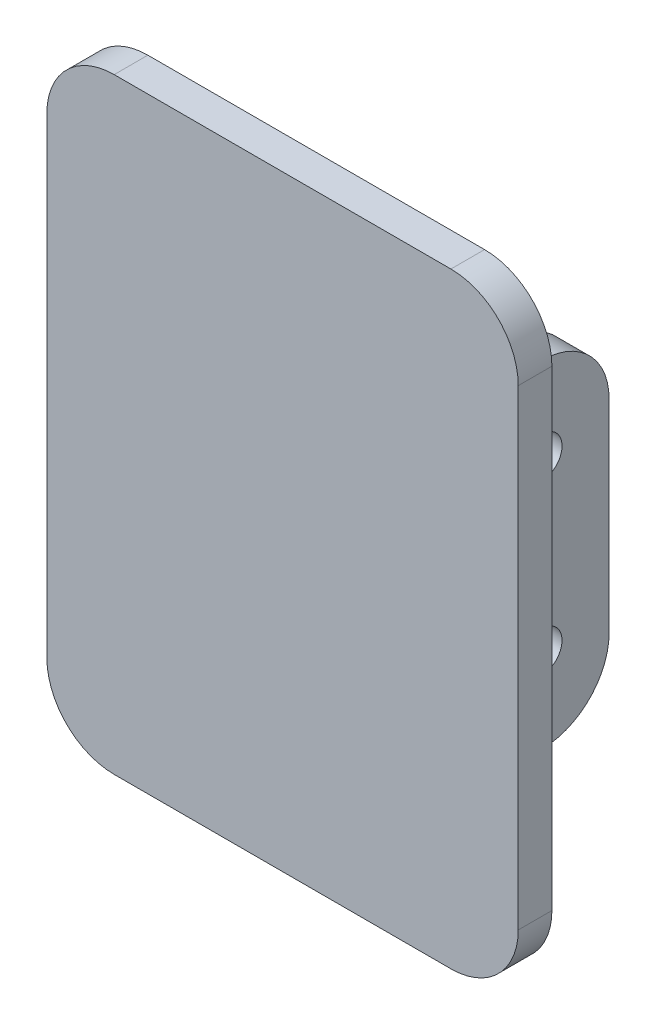
ISO-10303-21;
HEADER;
FILE_DESCRIPTION(('STEP AP214'),'2;1');
FILE_NAME('part.step','',(''),(''),'','','');
FILE_SCHEMA(('AUTOMOTIVE_DESIGN { 1 0 10303 214 1 1 1 1 }'));
ENDSEC;
DATA;
#1=APPLICATION_CONTEXT('core data for automotive mechanical design processes');
#2=APPLICATION_PROTOCOL_DEFINITION('international standard','automotive_design',2000,#1);
#3=PRODUCT_CONTEXT('',#1,'mechanical');
#4=PRODUCT('Part','Part','',(#3));
#5=PRODUCT_RELATED_PRODUCT_CATEGORY('part','',(#4));
#6=PRODUCT_DEFINITION_FORMATION('','',#4);
#7=PRODUCT_DEFINITION_CONTEXT('part definition',#1,'design');
#8=PRODUCT_DEFINITION('design','',#6,#7);
#9=PRODUCT_DEFINITION_SHAPE('','',#8);
#10=(LENGTH_UNIT() NAMED_UNIT(*) SI_UNIT(.MILLI.,.METRE.));
#11=(NAMED_UNIT(*) PLANE_ANGLE_UNIT() SI_UNIT($,.RADIAN.));
#12=(NAMED_UNIT(*) SI_UNIT($,.STERADIAN.) SOLID_ANGLE_UNIT());
#13=UNCERTAINTY_MEASURE_WITH_UNIT(LENGTH_MEASURE(1.E-05),#10,'distance_accuracy_value','');
#14=(GEOMETRIC_REPRESENTATION_CONTEXT(3) GLOBAL_UNCERTAINTY_ASSIGNED_CONTEXT((#13)) GLOBAL_UNIT_ASSIGNED_CONTEXT((#10,
#11,#12)) REPRESENTATION_CONTEXT('',''));
#15=CARTESIAN_POINT('',(0.,0.,0.));
#16=DIRECTION('',(0.,0.,1.));
#17=DIRECTION('',(1.,0.,0.));
#18=AXIS2_PLACEMENT_3D('',#15,#16,#17);
#19=CARTESIAN_POINT('',(0.,0.,0.));
#20=DIRECTION('',(0.,0.,1.));
#21=DIRECTION('',(1.,0.,0.));
#22=AXIS2_PLACEMENT_3D('',#19,#20,#21);
#23=PLANE('',#22);
#24=DIRECTION('',(1.,0.,0.));
#25=VECTOR('',#24,1.);
#26=CARTESIAN_POINT('',(18.5,28.,0.));
#27=LINE('',#26,#25);
#28=CARTESIAN_POINT('',(26.5,28.,0.));
#29=VERTEX_POINT('',#28);
#30=CARTESIAN_POINT('',(18.5,28.,0.));
#31=VERTEX_POINT('',#30);
#32=EDGE_CURVE('E234',#29,#31,#27,.F.);
#33=ORIENTED_EDGE('',*,*,#32,.T.);
#34=DIRECTION('',(0.,1.,0.));
#35=VECTOR('',#34,1.);
#36=CARTESIAN_POINT('',(18.5,25.,0.));
#37=LINE('',#36,#35);
#38=CARTESIAN_POINT('',(18.5,-28.,0.));
#39=VERTEX_POINT('',#38);
#40=EDGE_CURVE('E411',#39,#31,#37,.T.);
#41=ORIENTED_EDGE('',*,*,#40,.F.);
#42=DIRECTION('',(-1.,0.,0.));
#43=VECTOR('',#42,1.);
#44=CARTESIAN_POINT('',(23.5,-28.,0.));
#45=LINE('',#44,#43);
#46=CARTESIAN_POINT('',(26.5,-28.,0.));
#47=VERTEX_POINT('',#46);
#48=EDGE_CURVE('E245',#39,#47,#45,.F.);
#49=ORIENTED_EDGE('',*,*,#48,.T.);
#50=DIRECTION('',(0.,-1.,0.));
#51=VECTOR('',#50,1.);
#52=CARTESIAN_POINT('',(26.5,25.,0.));
#53=LINE('',#52,#51);
#54=EDGE_CURVE('E231',#47,#29,#53,.F.);
#55=ORIENTED_EDGE('',*,*,#54,.T.);
#56=EDGE_LOOP('',(#33,#41,#49,#55));
#57=FACE_BOUND('',#56,.T.);
#58=DIRECTION('',(1.,0.,0.));
#59=VECTOR('',#58,1.);
#60=CARTESIAN_POINT('',(-35.,-45.,0.));
#61=LINE('',#60,#59);
#62=CARTESIAN_POINT('',(-25.,-45.,0.));
#63=VERTEX_POINT('',#62);
#64=CARTESIAN_POINT('',(25.,-45.,0.));
#65=VERTEX_POINT('',#64);
#66=EDGE_CURVE('E377',#63,#65,#61,.T.);
#67=ORIENTED_EDGE('',*,*,#66,.F.);
#68=CARTESIAN_POINT('',(-25.,-35.,0.));
#69=DIRECTION('',(0.,0.,1.));
#70=DIRECTION('',(1.,0.,0.));
#71=AXIS2_PLACEMENT_3D('',#68,#69,#70);
#72=CIRCLE('',#71,10.);
#73=CARTESIAN_POINT('',(-35.,-35.,0.));
#74=VERTEX_POINT('',#73);
#75=EDGE_CURVE('E332',#63,#74,#72,.F.);
#76=ORIENTED_EDGE('',*,*,#75,.T.);
#77=DIRECTION('',(0.,-1.,0.));
#78=VECTOR('',#77,1.);
#79=CARTESIAN_POINT('',(-35.,45.,0.));
#80=LINE('',#79,#78);
#81=CARTESIAN_POINT('',(-35.,35.,0.));
#82=VERTEX_POINT('',#81);
#83=EDGE_CURVE('E369',#82,#74,#80,.T.);
#84=ORIENTED_EDGE('',*,*,#83,.F.);
#85=CARTESIAN_POINT('',(-25.,35.,0.));
#86=DIRECTION('',(0.,0.,1.));
#87=DIRECTION('',(1.,0.,0.));
#88=AXIS2_PLACEMENT_3D('',#85,#86,#87);
#89=CIRCLE('',#88,10.);
#90=CARTESIAN_POINT('',(-25.,45.,0.));
#91=VERTEX_POINT('',#90);
#92=EDGE_CURVE('E326',#82,#91,#89,.F.);
#93=ORIENTED_EDGE('',*,*,#92,.T.);
#94=DIRECTION('',(-1.,0.,0.));
#95=VECTOR('',#94,1.);
#96=CARTESIAN_POINT('',(-35.,45.,0.));
#97=LINE('',#96,#95);
#98=CARTESIAN_POINT('',(25.,45.,0.));
#99=VERTEX_POINT('',#98);
#100=EDGE_CURVE('E366',#99,#91,#97,.T.);
#101=ORIENTED_EDGE('',*,*,#100,.F.);
#102=CARTESIAN_POINT('',(25.,35.,0.));
#103=DIRECTION('',(0.,0.,1.));
#104=DIRECTION('',(1.,0.,0.));
#105=AXIS2_PLACEMENT_3D('',#102,#103,#104);
#106=CIRCLE('',#105,10.);
#107=CARTESIAN_POINT('',(35.,35.,0.));
#108=VERTEX_POINT('',#107);
#109=EDGE_CURVE('E328',#99,#108,#106,.F.);
#110=ORIENTED_EDGE('',*,*,#109,.T.);
#111=DIRECTION('',(0.,1.,0.));
#112=VECTOR('',#111,1.);
#113=CARTESIAN_POINT('',(35.,45.,0.));
#114=LINE('',#113,#112);
#115=CARTESIAN_POINT('',(35.,-35.,0.));
#116=VERTEX_POINT('',#115);
#117=EDGE_CURVE('E356',#116,#108,#114,.T.);
#118=ORIENTED_EDGE('',*,*,#117,.F.);
#119=CARTESIAN_POINT('',(25.,-35.,0.));
#120=DIRECTION('',(0.,0.,1.));
#121=DIRECTION('',(1.,0.,0.));
#122=AXIS2_PLACEMENT_3D('',#119,#120,#121);
#123=CIRCLE('',#122,10.);
#124=EDGE_CURVE('E330',#116,#65,#123,.F.);
#125=ORIENTED_EDGE('',*,*,#124,.T.);
#126=EDGE_LOOP('',(#67,#76,#84,#93,#101,#110,#118,#125));
#127=FACE_BOUND('',#126,.T.);
#128=DIRECTION('',(0.,-1.,0.));
#129=VECTOR('',#128,1.);
#130=CARTESIAN_POINT('',(3.50000000000001,25.,0.));
#131=LINE('',#130,#129);
#132=CARTESIAN_POINT('',(3.50000000000001,28.,0.));
#133=VERTEX_POINT('',#132);
#134=CARTESIAN_POINT('',(3.5,-28.,0.));
#135=VERTEX_POINT('',#134);
#136=EDGE_CURVE('E399',#133,#135,#131,.T.);
#137=ORIENTED_EDGE('',*,*,#136,.F.);
#138=DIRECTION('',(1.,0.,0.));
#139=VECTOR('',#138,1.);
#140=CARTESIAN_POINT('',(-1.49999999999999,28.,0.));
#141=LINE('',#140,#139);
#142=CARTESIAN_POINT('',(-4.49999999999999,28.,0.));
#143=VERTEX_POINT('',#142);
#144=EDGE_CURVE('E224',#133,#143,#141,.F.);
#145=ORIENTED_EDGE('',*,*,#144,.T.);
#146=DIRECTION('',(0.,1.,0.));
#147=VECTOR('',#146,1.);
#148=CARTESIAN_POINT('',(-4.5,-25.,0.));
#149=LINE('',#148,#147);
#150=CARTESIAN_POINT('',(-4.5,-28.,0.));
#151=VERTEX_POINT('',#150);
#152=EDGE_CURVE('E250',#143,#151,#149,.F.);
#153=ORIENTED_EDGE('',*,*,#152,.T.);
#154=DIRECTION('',(-1.,0.,0.));
#155=VECTOR('',#154,1.);
#156=CARTESIAN_POINT('',(3.5,-28.,0.));
#157=LINE('',#156,#155);
#158=EDGE_CURVE('E247',#151,#135,#157,.F.);
#159=ORIENTED_EDGE('',*,*,#158,.T.);
#160=EDGE_LOOP('',(#137,#145,#153,#159));
#161=FACE_BOUND('',#160,.T.);
#162=ADVANCED_FACE('F44',(#57,#127,#161),#23,.F.);
#163=CARTESIAN_POINT('',(35.,45.,5.));
#164=DIRECTION('',(-1.,0.,0.));
#165=DIRECTION('',(0.,-1.,0.));
#166=AXIS2_PLACEMENT_3D('',#163,#164,#165);
#167=PLANE('',#166);
#168=DIRECTION('',(0.,1.,0.));
#169=VECTOR('',#168,1.);
#170=CARTESIAN_POINT('',(35.,45.,5.));
#171=LINE('',#170,#169);
#172=CARTESIAN_POINT('',(35.,-35.,5.));
#173=VERTEX_POINT('',#172);
#174=CARTESIAN_POINT('',(35.,35.,5.));
#175=VERTEX_POINT('',#174);
#176=EDGE_CURVE('E358',#173,#175,#171,.T.);
#177=ORIENTED_EDGE('',*,*,#176,.F.);
#178=DIRECTION('',(0.,0.,-1.));
#179=VECTOR('',#178,1.);
#180=CARTESIAN_POINT('',(35.,-35.,5.));
#181=LINE('',#180,#179);
#182=EDGE_CURVE('E348',#173,#116,#181,.T.);
#183=ORIENTED_EDGE('',*,*,#182,.T.);
#184=ORIENTED_EDGE('',*,*,#117,.T.);
#185=DIRECTION('',(0.,0.,-1.));
#186=VECTOR('',#185,1.);
#187=CARTESIAN_POINT('',(35.,35.,5.));
#188=LINE('',#187,#186);
#189=EDGE_CURVE('E346',#108,#175,#188,.F.);
#190=ORIENTED_EDGE('',*,*,#189,.T.);
#191=EDGE_LOOP('',(#177,#183,#184,#190));
#192=FACE_BOUND('',#191,.T.);
#193=ADVANCED_FACE('F355',(#192),#167,.F.);
#194=CARTESIAN_POINT('',(-35.,45.,5.));
#195=DIRECTION('',(0.,-1.,0.));
#196=DIRECTION('',(0.,0.,-1.));
#197=AXIS2_PLACEMENT_3D('',#194,#195,#196);
#198=PLANE('',#197);
#199=DIRECTION('',(-1.,0.,0.));
#200=VECTOR('',#199,1.);
#201=CARTESIAN_POINT('',(-35.,45.,5.));
#202=LINE('',#201,#200);
#203=CARTESIAN_POINT('',(25.,45.,5.));
#204=VERTEX_POINT('',#203);
#205=CARTESIAN_POINT('',(-25.,45.,5.));
#206=VERTEX_POINT('',#205);
#207=EDGE_CURVE('E425',#204,#206,#202,.T.);
#208=ORIENTED_EDGE('',*,*,#207,.F.);
#209=DIRECTION('',(0.,0.,-1.));
#210=VECTOR('',#209,1.);
#211=CARTESIAN_POINT('',(25.,45.,5.));
#212=LINE('',#211,#210);
#213=EDGE_CURVE('E13',#204,#99,#212,.T.);
#214=ORIENTED_EDGE('',*,*,#213,.T.);
#215=ORIENTED_EDGE('',*,*,#100,.T.);
#216=DIRECTION('',(0.,0.,-1.));
#217=VECTOR('',#216,1.);
#218=CARTESIAN_POINT('',(-25.,45.,5.));
#219=LINE('',#218,#217);
#220=EDGE_CURVE('E52',#91,#206,#219,.F.);
#221=ORIENTED_EDGE('',*,*,#220,.T.);
#222=EDGE_LOOP('',(#208,#214,#215,#221));
#223=FACE_BOUND('',#222,.T.);
#224=ADVANCED_FACE('F444',(#223),#198,.F.);
#225=CARTESIAN_POINT('',(-35.,45.,5.));
#226=DIRECTION('',(1.,0.,0.));
#227=DIRECTION('',(0.,1.,0.));
#228=AXIS2_PLACEMENT_3D('',#225,#226,#227);
#229=PLANE('',#228);
#230=ORIENTED_EDGE('',*,*,#83,.T.);
#231=DIRECTION('',(0.,0.,-1.));
#232=VECTOR('',#231,1.);
#233=CARTESIAN_POINT('',(-35.,-35.,5.));
#234=LINE('',#233,#232);
#235=CARTESIAN_POINT('',(-35.,-35.,5.));
#236=VERTEX_POINT('',#235);
#237=EDGE_CURVE('E337',#74,#236,#234,.F.);
#238=ORIENTED_EDGE('',*,*,#237,.T.);
#239=DIRECTION('',(0.,-1.,0.));
#240=VECTOR('',#239,1.);
#241=CARTESIAN_POINT('',(-35.,45.,5.));
#242=LINE('',#241,#240);
#243=CARTESIAN_POINT('',(-35.,35.,5.));
#244=VERTEX_POINT('',#243);
#245=EDGE_CURVE('E237',#244,#236,#242,.T.);
#246=ORIENTED_EDGE('',*,*,#245,.F.);
#247=DIRECTION('',(0.,0.,-1.));
#248=VECTOR('',#247,1.);
#249=CARTESIAN_POINT('',(-35.,35.,5.));
#250=LINE('',#249,#248);
#251=EDGE_CURVE('E334',#244,#82,#250,.T.);
#252=ORIENTED_EDGE('',*,*,#251,.T.);
#253=EDGE_LOOP('',(#230,#238,#246,#252));
#254=FACE_BOUND('',#253,.T.);
#255=ADVANCED_FACE('F442',(#254),#229,.F.);
#256=CARTESIAN_POINT('',(-35.,-45.,5.));
#257=DIRECTION('',(0.,1.,0.));
#258=DIRECTION('',(0.,0.,1.));
#259=AXIS2_PLACEMENT_3D('',#256,#257,#258);
#260=PLANE('',#259);
#261=DIRECTION('',(1.,0.,0.));
#262=VECTOR('',#261,1.);
#263=CARTESIAN_POINT('',(-35.,-45.,5.));
#264=LINE('',#263,#262);
#265=CARTESIAN_POINT('',(-25.,-45.,5.));
#266=VERTEX_POINT('',#265);
#267=CARTESIAN_POINT('',(25.,-45.,5.));
#268=VERTEX_POINT('',#267);
#269=EDGE_CURVE('E232',#266,#268,#264,.T.);
#270=ORIENTED_EDGE('',*,*,#269,.F.);
#271=DIRECTION('',(0.,0.,-1.));
#272=VECTOR('',#271,1.);
#273=CARTESIAN_POINT('',(-25.,-45.,5.));
#274=LINE('',#273,#272);
#275=EDGE_CURVE('E323',#266,#63,#274,.T.);
#276=ORIENTED_EDGE('',*,*,#275,.T.);
#277=ORIENTED_EDGE('',*,*,#66,.T.);
#278=DIRECTION('',(0.,0.,-1.));
#279=VECTOR('',#278,1.);
#280=CARTESIAN_POINT('',(25.,-45.,5.));
#281=LINE('',#280,#279);
#282=EDGE_CURVE('E321',#65,#268,#281,.F.);
#283=ORIENTED_EDGE('',*,*,#282,.T.);
#284=EDGE_LOOP('',(#270,#276,#277,#283));
#285=FACE_BOUND('',#284,.T.);
#286=ADVANCED_FACE('F439',(#285),#260,.F.);
#287=CARTESIAN_POINT('',(0.,0.,5.));
#288=DIRECTION('',(0.,0.,1.));
#289=DIRECTION('',(1.,0.,0.));
#290=AXIS2_PLACEMENT_3D('',#287,#288,#289);
#291=PLANE('',#290);
#292=ORIENTED_EDGE('',*,*,#245,.T.);
#293=CARTESIAN_POINT('',(-25.,-35.,5.));
#294=DIRECTION('',(0.,0.,1.));
#295=DIRECTION('',(1.,0.,0.));
#296=AXIS2_PLACEMENT_3D('',#293,#294,#295);
#297=CIRCLE('',#296,10.);
#298=EDGE_CURVE('E344',#236,#266,#297,.T.);
#299=ORIENTED_EDGE('',*,*,#298,.T.);
#300=ORIENTED_EDGE('',*,*,#269,.T.);
#301=CARTESIAN_POINT('',(25.,-35.,5.));
#302=DIRECTION('',(0.,0.,1.));
#303=DIRECTION('',(1.,0.,0.));
#304=AXIS2_PLACEMENT_3D('',#301,#302,#303);
#305=CIRCLE('',#304,10.);
#306=EDGE_CURVE('E342',#268,#173,#305,.T.);
#307=ORIENTED_EDGE('',*,*,#306,.T.);
#308=ORIENTED_EDGE('',*,*,#176,.T.);
#309=CARTESIAN_POINT('',(25.,35.,5.));
#310=DIRECTION('',(0.,0.,1.));
#311=DIRECTION('',(1.,0.,0.));
#312=AXIS2_PLACEMENT_3D('',#309,#310,#311);
#313=CIRCLE('',#312,10.);
#314=EDGE_CURVE('E65',#175,#204,#313,.T.);
#315=ORIENTED_EDGE('',*,*,#314,.T.);
#316=ORIENTED_EDGE('',*,*,#207,.T.);
#317=CARTESIAN_POINT('',(-25.,35.,5.));
#318=DIRECTION('',(0.,0.,1.));
#319=DIRECTION('',(1.,0.,0.));
#320=AXIS2_PLACEMENT_3D('',#317,#318,#319);
#321=CIRCLE('',#320,10.);
#322=EDGE_CURVE('E339',#206,#244,#321,.T.);
#323=ORIENTED_EDGE('',*,*,#322,.T.);
#324=EDGE_LOOP('',(#292,#299,#300,#307,#308,#315,#316,#323));
#325=FACE_BOUND('',#324,.T.);
#326=ADVANCED_FACE('F429',(#325),#291,.T.);
#327=CARTESIAN_POINT('',(18.5,25.,-20.));
#328=DIRECTION('',(1.,0.,0.));
#329=DIRECTION('',(0.,1.,0.));
#330=AXIS2_PLACEMENT_3D('',#327,#328,#329);
#331=PLANE('',#330);
#332=CARTESIAN_POINT('',(18.5,-12.5,-10.));
#333=DIRECTION('',(1.,0.,0.));
#334=DIRECTION('',(0.,1.,0.));
#335=AXIS2_PLACEMENT_3D('',#332,#333,#334);
#336=CIRCLE('',#335,3.);
#337=CARTESIAN_POINT('',(18.5,-9.50000000000001,-10.));
#338=VERTEX_POINT('',#337);
#339=EDGE_CURVE('E388',#338,#338,#336,.T.);
#340=ORIENTED_EDGE('',*,*,#339,.T.);
#341=EDGE_LOOP('',(#340));
#342=FACE_BOUND('',#341,.T.);
#343=CARTESIAN_POINT('',(18.5,12.5,-10.));
#344=DIRECTION('',(1.,0.,0.));
#345=DIRECTION('',(0.,1.,0.));
#346=AXIS2_PLACEMENT_3D('',#343,#344,#345);
#347=CIRCLE('',#346,3.);
#348=CARTESIAN_POINT('',(18.5,15.5,-10.));
#349=VERTEX_POINT('',#348);
#350=EDGE_CURVE('E385',#349,#349,#347,.T.);
#351=ORIENTED_EDGE('',*,*,#350,.T.);
#352=EDGE_LOOP('',(#351));
#353=FACE_BOUND('',#352,.T.);
#354=DIRECTION('',(0.,1.,0.));
#355=VECTOR('',#354,1.);
#356=CARTESIAN_POINT('',(18.5,25.,-20.));
#357=LINE('',#356,#355);
#358=CARTESIAN_POINT('',(18.5,-15.,-20.));
#359=VERTEX_POINT('',#358);
#360=CARTESIAN_POINT('',(18.5,15.,-20.));
#361=VERTEX_POINT('',#360);
#362=EDGE_CURVE('E412',#359,#361,#357,.T.);
#363=ORIENTED_EDGE('',*,*,#362,.F.);
#364=CARTESIAN_POINT('',(18.5,-15.,-10.));
#365=DIRECTION('',(1.,0.,0.));
#366=DIRECTION('',(0.,1.,0.));
#367=AXIS2_PLACEMENT_3D('',#364,#365,#366);
#368=CIRCLE('',#367,10.);
#369=CARTESIAN_POINT('',(18.5,-25.,-10.));
#370=VERTEX_POINT('',#369);
#371=EDGE_CURVE('E311',#359,#370,#368,.F.);
#372=ORIENTED_EDGE('',*,*,#371,.T.);
#373=DIRECTION('',(0.,0.,1.));
#374=VECTOR('',#373,1.);
#375=CARTESIAN_POINT('',(18.5,-25.,-20.));
#376=LINE('',#375,#374);
#377=CARTESIAN_POINT('',(18.5,-25.,-3.));
#378=VERTEX_POINT('',#377);
#379=EDGE_CURVE('E418',#370,#378,#376,.T.);
#380=ORIENTED_EDGE('',*,*,#379,.T.);
#381=CARTESIAN_POINT('',(18.5,-28.,-3.));
#382=DIRECTION('',(1.,0.,0.));
#383=DIRECTION('',(0.,1.,0.));
#384=AXIS2_PLACEMENT_3D('',#381,#382,#383);
#385=CIRCLE('',#384,3.);
#386=EDGE_CURVE('E268',#378,#39,#385,.T.);
#387=ORIENTED_EDGE('',*,*,#386,.T.);
#388=ORIENTED_EDGE('',*,*,#40,.T.);
#389=CARTESIAN_POINT('',(18.5,28.,-3.));
#390=DIRECTION('',(1.,0.,0.));
#391=DIRECTION('',(0.,1.,0.));
#392=AXIS2_PLACEMENT_3D('',#389,#390,#391);
#393=CIRCLE('',#392,3.);
#394=CARTESIAN_POINT('',(18.5,25.,-3.));
#395=VERTEX_POINT('',#394);
#396=EDGE_CURVE('E271',#31,#395,#393,.T.);
#397=ORIENTED_EDGE('',*,*,#396,.T.);
#398=DIRECTION('',(0.,0.,1.));
#399=VECTOR('',#398,1.);
#400=CARTESIAN_POINT('',(18.5,25.,-20.));
#401=LINE('',#400,#399);
#402=CARTESIAN_POINT('',(18.5,25.,-10.));
#403=VERTEX_POINT('',#402);
#404=EDGE_CURVE('E367',#403,#395,#401,.T.);
#405=ORIENTED_EDGE('',*,*,#404,.F.);
#406=CARTESIAN_POINT('',(18.5,15.,-10.));
#407=DIRECTION('',(1.,0.,0.));
#408=DIRECTION('',(0.,1.,0.));
#409=AXIS2_PLACEMENT_3D('',#406,#407,#408);
#410=CIRCLE('',#409,10.);
#411=EDGE_CURVE('E309',#403,#361,#410,.F.);
#412=ORIENTED_EDGE('',*,*,#411,.T.);
#413=EDGE_LOOP('',(#363,#372,#380,#387,#388,#397,#405,#412));
#414=FACE_BOUND('',#413,.T.);
#415=ADVANCED_FACE('F518',(#342,#353,#414),#331,.F.);
#416=CARTESIAN_POINT('',(23.5,25.,-20.));
#417=DIRECTION('',(0.,-1.,0.));
#418=DIRECTION('',(0.,0.,-1.));
#419=AXIS2_PLACEMENT_3D('',#416,#417,#418);
#420=PLANE('',#419);
#421=DIRECTION('',(0.,0.,1.));
#422=VECTOR('',#421,1.);
#423=CARTESIAN_POINT('',(23.5,25.,-20.));
#424=LINE('',#423,#422);
#425=CARTESIAN_POINT('',(23.5,25.,-10.));
#426=VERTEX_POINT('',#425);
#427=CARTESIAN_POINT('',(23.5,25.,-3.));
#428=VERTEX_POINT('',#427);
#429=EDGE_CURVE('E371',#426,#428,#424,.T.);
#430=ORIENTED_EDGE('',*,*,#429,.F.);
#431=DIRECTION('',(1.,0.,0.));
#432=VECTOR('',#431,1.);
#433=CARTESIAN_POINT('',(18.5,25.,-10.));
#434=LINE('',#433,#432);
#435=EDGE_CURVE('E319',#426,#403,#434,.F.);
#436=ORIENTED_EDGE('',*,*,#435,.T.);
#437=ORIENTED_EDGE('',*,*,#404,.T.);
#438=DIRECTION('',(1.,0.,0.));
#439=VECTOR('',#438,1.);
#440=CARTESIAN_POINT('',(23.5,25.,-3.));
#441=LINE('',#440,#439);
#442=EDGE_CURVE('E261',#395,#428,#441,.T.);
#443=ORIENTED_EDGE('',*,*,#442,.T.);
#444=EDGE_LOOP('',(#430,#436,#437,#443));
#445=FACE_BOUND('',#444,.T.);
#446=ADVANCED_FACE('F541',(#445),#420,.F.);
#447=CARTESIAN_POINT('',(23.5,25.,-20.));
#448=DIRECTION('',(-1.,0.,0.));
#449=DIRECTION('',(0.,-1.,0.));
#450=AXIS2_PLACEMENT_3D('',#447,#448,#449);
#451=PLANE('',#450);
#452=CARTESIAN_POINT('',(23.5,-12.5,-10.));
#453=DIRECTION('',(1.,0.,0.));
#454=DIRECTION('',(0.,1.,0.));
#455=AXIS2_PLACEMENT_3D('',#452,#453,#454);
#456=CIRCLE('',#455,3.);
#457=CARTESIAN_POINT('',(23.5,-9.50000000000001,-10.));
#458=VERTEX_POINT('',#457);
#459=EDGE_CURVE('E281',#458,#458,#456,.T.);
#460=ORIENTED_EDGE('',*,*,#459,.F.);
#461=EDGE_LOOP('',(#460));
#462=FACE_BOUND('',#461,.T.);
#463=CARTESIAN_POINT('',(23.5,12.5,-10.));
#464=DIRECTION('',(1.,0.,0.));
#465=DIRECTION('',(0.,1.,0.));
#466=AXIS2_PLACEMENT_3D('',#463,#464,#465);
#467=CIRCLE('',#466,3.);
#468=CARTESIAN_POINT('',(23.5,15.5,-10.));
#469=VERTEX_POINT('',#468);
#470=EDGE_CURVE('E381',#469,#469,#467,.T.);
#471=ORIENTED_EDGE('',*,*,#470,.F.);
#472=EDGE_LOOP('',(#471));
#473=FACE_BOUND('',#472,.T.);
#474=DIRECTION('',(0.,0.,1.));
#475=VECTOR('',#474,1.);
#476=CARTESIAN_POINT('',(23.5,-25.,-20.));
#477=LINE('',#476,#475);
#478=CARTESIAN_POINT('',(23.5,-25.,-10.));
#479=VERTEX_POINT('',#478);
#480=CARTESIAN_POINT('',(23.5,-25.,-3.));
#481=VERTEX_POINT('',#480);
#482=EDGE_CURVE('E421',#479,#481,#477,.T.);
#483=ORIENTED_EDGE('',*,*,#482,.F.);
#484=CARTESIAN_POINT('',(23.5,-15.,-10.));
#485=DIRECTION('',(-1.,0.,0.));
#486=DIRECTION('',(0.,-1.,0.));
#487=AXIS2_PLACEMENT_3D('',#484,#485,#486);
#488=CIRCLE('',#487,10.);
#489=CARTESIAN_POINT('',(23.5,-15.,-20.));
#490=VERTEX_POINT('',#489);
#491=EDGE_CURVE('E317',#479,#490,#488,.F.);
#492=ORIENTED_EDGE('',*,*,#491,.T.);
#493=DIRECTION('',(0.,-1.,0.));
#494=VECTOR('',#493,1.);
#495=CARTESIAN_POINT('',(23.5,25.,-20.));
#496=LINE('',#495,#494);
#497=CARTESIAN_POINT('',(23.5,15.,-20.));
#498=VERTEX_POINT('',#497);
#499=EDGE_CURVE('E415',#498,#490,#496,.T.);
#500=ORIENTED_EDGE('',*,*,#499,.F.);
#501=CARTESIAN_POINT('',(23.5,15.,-10.));
#502=DIRECTION('',(-1.,0.,0.));
#503=DIRECTION('',(0.,-1.,0.));
#504=AXIS2_PLACEMENT_3D('',#501,#502,#503);
#505=CIRCLE('',#504,10.);
#506=EDGE_CURVE('E315',#498,#426,#505,.F.);
#507=ORIENTED_EDGE('',*,*,#506,.T.);
#508=ORIENTED_EDGE('',*,*,#429,.T.);
#509=DIRECTION('',(0.,-1.,0.));
#510=VECTOR('',#509,1.);
#511=CARTESIAN_POINT('',(23.5,-25.,-3.));
#512=LINE('',#511,#510);
#513=EDGE_CURVE('E226',#428,#481,#512,.T.);
#514=ORIENTED_EDGE('',*,*,#513,.T.);
#515=EDGE_LOOP('',(#483,#492,#500,#507,#508,#514));
#516=FACE_BOUND('',#515,.T.);
#517=ADVANCED_FACE('F543',(#462,#473,#516),#451,.F.);
#518=CARTESIAN_POINT('',(23.5,-25.,-20.));
#519=DIRECTION('',(0.,1.,0.));
#520=DIRECTION('',(0.,0.,1.));
#521=AXIS2_PLACEMENT_3D('',#518,#519,#520);
#522=PLANE('',#521);
#523=ORIENTED_EDGE('',*,*,#379,.F.);
#524=DIRECTION('',(-1.,0.,0.));
#525=VECTOR('',#524,1.);
#526=CARTESIAN_POINT('',(23.5,-25.,-10.));
#527=LINE('',#526,#525);
#528=EDGE_CURVE('E313',#370,#479,#527,.F.);
#529=ORIENTED_EDGE('',*,*,#528,.T.);
#530=ORIENTED_EDGE('',*,*,#482,.T.);
#531=DIRECTION('',(-1.,0.,0.));
#532=VECTOR('',#531,1.);
#533=CARTESIAN_POINT('',(18.5,-25.,-3.));
#534=LINE('',#533,#532);
#535=EDGE_CURVE('E258',#481,#378,#534,.T.);
#536=ORIENTED_EDGE('',*,*,#535,.T.);
#537=EDGE_LOOP('',(#523,#529,#530,#536));
#538=FACE_BOUND('',#537,.T.);
#539=ADVANCED_FACE('F528',(#538),#522,.F.);
#540=CARTESIAN_POINT('',(0.,0.,-20.));
#541=DIRECTION('',(0.,0.,-1.));
#542=DIRECTION('',(-1.,0.,0.));
#543=AXIS2_PLACEMENT_3D('',#540,#541,#542);
#544=PLANE('',#543);
#545=ORIENTED_EDGE('',*,*,#499,.T.);
#546=DIRECTION('',(-1.,0.,0.));
#547=VECTOR('',#546,1.);
#548=CARTESIAN_POINT('',(18.5,-15.,-20.));
#549=LINE('',#548,#547);
#550=EDGE_CURVE('E306',#490,#359,#549,.T.);
#551=ORIENTED_EDGE('',*,*,#550,.T.);
#552=ORIENTED_EDGE('',*,*,#362,.T.);
#553=DIRECTION('',(1.,0.,0.));
#554=VECTOR('',#553,1.);
#555=CARTESIAN_POINT('',(23.5,15.,-20.));
#556=LINE('',#555,#554);
#557=EDGE_CURVE('E303',#361,#498,#556,.T.);
#558=ORIENTED_EDGE('',*,*,#557,.T.);
#559=EDGE_LOOP('',(#545,#551,#552,#558));
#560=FACE_BOUND('',#559,.T.);
#561=ADVANCED_FACE('F520',(#560),#544,.T.);
#562=CARTESIAN_POINT('',(-1.49999999999999,25.,-20.));
#563=DIRECTION('',(1.,0.,0.));
#564=DIRECTION('',(0.,1.,0.));
#565=AXIS2_PLACEMENT_3D('',#562,#563,#564);
#566=PLANE('',#565);
#567=CARTESIAN_POINT('',(-1.49999999999999,-12.5,-10.));
#568=DIRECTION('',(1.,0.,0.));
#569=DIRECTION('',(0.,1.,0.));
#570=AXIS2_PLACEMENT_3D('',#567,#568,#569);
#571=CIRCLE('',#570,3.);
#572=CARTESIAN_POINT('',(-1.49999999999999,-9.5,-10.));
#573=VERTEX_POINT('',#572);
#574=EDGE_CURVE('E393',#573,#573,#571,.T.);
#575=ORIENTED_EDGE('',*,*,#574,.T.);
#576=EDGE_LOOP('',(#575));
#577=FACE_BOUND('',#576,.T.);
#578=CARTESIAN_POINT('',(-1.49999999999999,12.5,-10.));
#579=DIRECTION('',(1.,0.,0.));
#580=DIRECTION('',(0.,1.,0.));
#581=AXIS2_PLACEMENT_3D('',#578,#579,#580);
#582=CIRCLE('',#581,3.);
#583=CARTESIAN_POINT('',(-1.49999999999999,15.5,-10.));
#584=VERTEX_POINT('',#583);
#585=EDGE_CURVE('E380',#584,#584,#582,.T.);
#586=ORIENTED_EDGE('',*,*,#585,.T.);
#587=EDGE_LOOP('',(#586));
#588=FACE_BOUND('',#587,.T.);
#589=DIRECTION('',(0.,0.,1.));
#590=VECTOR('',#589,1.);
#591=CARTESIAN_POINT('',(-1.49999999999999,25.,-20.));
#592=LINE('',#591,#590);
#593=CARTESIAN_POINT('',(-1.49999999999999,25.,-10.));
#594=VERTEX_POINT('',#593);
#595=CARTESIAN_POINT('',(-1.49999999999999,25.,-3.));
#596=VERTEX_POINT('',#595);
#597=EDGE_CURVE('E216',#594,#596,#592,.T.);
#598=ORIENTED_EDGE('',*,*,#597,.F.);
#599=CARTESIAN_POINT('',(-1.5,15.,-10.));
#600=DIRECTION('',(1.,0.,0.));
#601=DIRECTION('',(0.,1.,0.));
#602=AXIS2_PLACEMENT_3D('',#599,#600,#601);
#603=CIRCLE('',#602,10.);
#604=CARTESIAN_POINT('',(-1.5,15.,-20.));
#605=VERTEX_POINT('',#604);
#606=EDGE_CURVE('E299',#594,#605,#603,.F.);
#607=ORIENTED_EDGE('',*,*,#606,.T.);
#608=DIRECTION('',(0.,1.,0.));
#609=VECTOR('',#608,1.);
#610=CARTESIAN_POINT('',(-1.49999999999999,25.,-20.));
#611=LINE('',#610,#609);
#612=CARTESIAN_POINT('',(-1.5,-15.,-20.));
#613=VERTEX_POINT('',#612);
#614=EDGE_CURVE('E400',#613,#605,#611,.T.);
#615=ORIENTED_EDGE('',*,*,#614,.F.);
#616=CARTESIAN_POINT('',(-1.5,-15.,-10.));
#617=DIRECTION('',(1.,0.,0.));
#618=DIRECTION('',(0.,1.,0.));
#619=AXIS2_PLACEMENT_3D('',#616,#617,#618);
#620=CIRCLE('',#619,10.);
#621=CARTESIAN_POINT('',(-1.5,-25.,-10.));
#622=VERTEX_POINT('',#621);
#623=EDGE_CURVE('E297',#613,#622,#620,.F.);
#624=ORIENTED_EDGE('',*,*,#623,.T.);
#625=DIRECTION('',(0.,0.,1.));
#626=VECTOR('',#625,1.);
#627=CARTESIAN_POINT('',(-1.5,-25.,-20.));
#628=LINE('',#627,#626);
#629=CARTESIAN_POINT('',(-1.5,-25.,-3.));
#630=VERTEX_POINT('',#629);
#631=EDGE_CURVE('E406',#622,#630,#628,.T.);
#632=ORIENTED_EDGE('',*,*,#631,.T.);
#633=DIRECTION('',(0.,1.,0.));
#634=VECTOR('',#633,1.);
#635=CARTESIAN_POINT('',(-1.49999999999999,25.,-3.));
#636=LINE('',#635,#634);
#637=EDGE_CURVE('E253',#630,#596,#636,.T.);
#638=ORIENTED_EDGE('',*,*,#637,.T.);
#639=EDGE_LOOP('',(#598,#607,#615,#624,#632,#638));
#640=FACE_BOUND('',#639,.T.);
#641=ADVANCED_FACE('F591',(#577,#588,#640),#566,.F.);
#642=CARTESIAN_POINT('',(-1.49999999999999,25.,-20.));
#643=DIRECTION('',(0.,-1.,0.));
#644=DIRECTION('',(0.,0.,-1.));
#645=AXIS2_PLACEMENT_3D('',#642,#643,#644);
#646=PLANE('',#645);
#647=DIRECTION('',(0.,0.,1.));
#648=VECTOR('',#647,1.);
#649=CARTESIAN_POINT('',(3.50000000000001,25.,-20.));
#650=LINE('',#649,#648);
#651=CARTESIAN_POINT('',(3.50000000000001,25.,-10.));
#652=VERTEX_POINT('',#651);
#653=CARTESIAN_POINT('',(3.50000000000001,25.,-3.));
#654=VERTEX_POINT('',#653);
#655=EDGE_CURVE('E206',#652,#654,#650,.T.);
#656=ORIENTED_EDGE('',*,*,#655,.F.);
#657=DIRECTION('',(1.,0.,0.));
#658=VECTOR('',#657,1.);
#659=CARTESIAN_POINT('',(-1.49999999999999,25.,-10.));
#660=LINE('',#659,#658);
#661=EDGE_CURVE('E295',#652,#594,#660,.F.);
#662=ORIENTED_EDGE('',*,*,#661,.T.);
#663=ORIENTED_EDGE('',*,*,#597,.T.);
#664=DIRECTION('',(1.,0.,0.));
#665=VECTOR('',#664,1.);
#666=CARTESIAN_POINT('',(3.50000000000001,25.,-3.));
#667=LINE('',#666,#665);
#668=EDGE_CURVE('E223',#596,#654,#667,.T.);
#669=ORIENTED_EDGE('',*,*,#668,.T.);
#670=EDGE_LOOP('',(#656,#662,#663,#669));
#671=FACE_BOUND('',#670,.T.);
#672=ADVANCED_FACE('F228',(#671),#646,.F.);
#673=CARTESIAN_POINT('',(3.50000000000001,25.,-20.));
#674=DIRECTION('',(-1.,0.,0.));
#675=DIRECTION('',(0.,-1.,0.));
#676=AXIS2_PLACEMENT_3D('',#673,#674,#675);
#677=PLANE('',#676);
#678=CARTESIAN_POINT('',(3.5,-12.5,-10.));
#679=DIRECTION('',(-1.,0.,0.));
#680=DIRECTION('',(0.,-1.,0.));
#681=AXIS2_PLACEMENT_3D('',#678,#679,#680);
#682=CIRCLE('',#681,3.);
#683=CARTESIAN_POINT('',(3.5,-15.5,-10.));
#684=VERTEX_POINT('',#683);
#685=EDGE_CURVE('E240',#684,#684,#682,.T.);
#686=ORIENTED_EDGE('',*,*,#685,.T.);
#687=EDGE_LOOP('',(#686));
#688=FACE_BOUND('',#687,.T.);
#689=CARTESIAN_POINT('',(3.50000000000001,12.5,-10.));
#690=DIRECTION('',(-1.,0.,0.));
#691=DIRECTION('',(0.,-1.,0.));
#692=AXIS2_PLACEMENT_3D('',#689,#690,#691);
#693=CIRCLE('',#692,3.);
#694=CARTESIAN_POINT('',(3.50000000000001,9.5,-10.));
#695=VERTEX_POINT('',#694);
#696=EDGE_CURVE('E378',#695,#695,#693,.T.);
#697=ORIENTED_EDGE('',*,*,#696,.T.);
#698=EDGE_LOOP('',(#697));
#699=FACE_BOUND('',#698,.T.);
#700=DIRECTION('',(0.,-1.,0.));
#701=VECTOR('',#700,1.);
#702=CARTESIAN_POINT('',(3.50000000000001,25.,-20.));
#703=LINE('',#702,#701);
#704=CARTESIAN_POINT('',(3.50000000000001,15.,-20.));
#705=VERTEX_POINT('',#704);
#706=CARTESIAN_POINT('',(3.5,-15.,-20.));
#707=VERTEX_POINT('',#706);
#708=EDGE_CURVE('E403',#705,#707,#703,.T.);
#709=ORIENTED_EDGE('',*,*,#708,.F.);
#710=CARTESIAN_POINT('',(3.50000000000001,15.,-10.));
#711=DIRECTION('',(-1.,0.,0.));
#712=DIRECTION('',(0.,-1.,0.));
#713=AXIS2_PLACEMENT_3D('',#710,#711,#712);
#714=CIRCLE('',#713,10.);
#715=EDGE_CURVE('E212',#705,#652,#714,.F.);
#716=ORIENTED_EDGE('',*,*,#715,.T.);
#717=ORIENTED_EDGE('',*,*,#655,.T.);
#718=CARTESIAN_POINT('',(3.50000000000001,28.,-3.));
#719=DIRECTION('',(-1.,0.,0.));
#720=DIRECTION('',(0.,-1.,0.));
#721=AXIS2_PLACEMENT_3D('',#718,#719,#720);
#722=CIRCLE('',#721,3.);
#723=EDGE_CURVE('E210',#654,#133,#722,.T.);
#724=ORIENTED_EDGE('',*,*,#723,.T.);
#725=ORIENTED_EDGE('',*,*,#136,.T.);
#726=CARTESIAN_POINT('',(3.5,-28.,-3.));
#727=DIRECTION('',(-1.,0.,0.));
#728=DIRECTION('',(0.,-1.,0.));
#729=AXIS2_PLACEMENT_3D('',#726,#727,#728);
#730=CIRCLE('',#729,3.);
#731=CARTESIAN_POINT('',(3.5,-25.,-3.));
#732=VERTEX_POINT('',#731);
#733=EDGE_CURVE('E225',#135,#732,#730,.T.);
#734=ORIENTED_EDGE('',*,*,#733,.T.);
#735=DIRECTION('',(0.,0.,1.));
#736=VECTOR('',#735,1.);
#737=CARTESIAN_POINT('',(3.5,-25.,-20.));
#738=LINE('',#737,#736);
#739=CARTESIAN_POINT('',(3.5,-25.,-10.));
#740=VERTEX_POINT('',#739);
#741=EDGE_CURVE('E217',#740,#732,#738,.T.);
#742=ORIENTED_EDGE('',*,*,#741,.F.);
#743=CARTESIAN_POINT('',(3.5,-15.,-10.));
#744=DIRECTION('',(-1.,0.,0.));
#745=DIRECTION('',(0.,-1.,0.));
#746=AXIS2_PLACEMENT_3D('',#743,#744,#745);
#747=CIRCLE('',#746,10.);
#748=EDGE_CURVE('E292',#740,#707,#747,.F.);
#749=ORIENTED_EDGE('',*,*,#748,.T.);
#750=EDGE_LOOP('',(#709,#716,#717,#724,#725,#734,#742,#749));
#751=FACE_BOUND('',#750,.T.);
#752=ADVANCED_FACE('F209',(#688,#699,#751),#677,.F.);
#753=CARTESIAN_POINT('',(-1.5,-25.,-20.));
#754=DIRECTION('',(0.,1.,0.));
#755=DIRECTION('',(0.,0.,1.));
#756=AXIS2_PLACEMENT_3D('',#753,#754,#755);
#757=PLANE('',#756);
#758=ORIENTED_EDGE('',*,*,#631,.F.);
#759=DIRECTION('',(-1.,0.,0.));
#760=VECTOR('',#759,1.);
#761=CARTESIAN_POINT('',(-1.5,-25.,-10.));
#762=LINE('',#761,#760);
#763=EDGE_CURVE('E301',#622,#740,#762,.F.);
#764=ORIENTED_EDGE('',*,*,#763,.T.);
#765=ORIENTED_EDGE('',*,*,#741,.T.);
#766=DIRECTION('',(-1.,0.,0.));
#767=VECTOR('',#766,1.);
#768=CARTESIAN_POINT('',(-1.5,-25.,-3.));
#769=LINE('',#768,#767);
#770=EDGE_CURVE('E255',#732,#630,#769,.T.);
#771=ORIENTED_EDGE('',*,*,#770,.T.);
#772=EDGE_LOOP('',(#758,#764,#765,#771));
#773=FACE_BOUND('',#772,.T.);
#774=ADVANCED_FACE('F581',(#773),#757,.F.);
#775=CARTESIAN_POINT('',(0.,0.,-20.));
#776=DIRECTION('',(0.,0.,1.));
#777=DIRECTION('',(1.,0.,0.));
#778=AXIS2_PLACEMENT_3D('',#775,#776,#777);
#779=PLANE('',#778);
#780=ORIENTED_EDGE('',*,*,#614,.T.);
#781=DIRECTION('',(1.,0.,0.));
#782=VECTOR('',#781,1.);
#783=CARTESIAN_POINT('',(0.,15.,-20.));
#784=LINE('',#783,#782);
#785=EDGE_CURVE('E289',#605,#705,#784,.T.);
#786=ORIENTED_EDGE('',*,*,#785,.T.);
#787=ORIENTED_EDGE('',*,*,#708,.T.);
#788=DIRECTION('',(-1.,0.,0.));
#789=VECTOR('',#788,1.);
#790=CARTESIAN_POINT('',(0.,-15.,-20.));
#791=LINE('',#790,#789);
#792=EDGE_CURVE('E274',#707,#613,#791,.T.);
#793=ORIENTED_EDGE('',*,*,#792,.T.);
#794=EDGE_LOOP('',(#780,#786,#787,#793));
#795=FACE_BOUND('',#794,.T.);
#796=ADVANCED_FACE('F576',(#795),#779,.F.);
#797=CARTESIAN_POINT('',(-35.,12.5,-10.));
#798=DIRECTION('',(1.,0.,0.));
#799=DIRECTION('',(0.,1.,0.));
#800=AXIS2_PLACEMENT_3D('',#797,#798,#799);
#801=CYLINDRICAL_SURFACE('',#800,3.);
#802=ORIENTED_EDGE('',*,*,#696,.F.);
#803=EDGE_LOOP('',(#802));
#804=FACE_BOUND('',#803,.T.);
#805=ORIENTED_EDGE('',*,*,#585,.F.);
#806=EDGE_LOOP('',(#805));
#807=FACE_BOUND('',#806,.T.);
#808=ADVANCED_FACE('F568',(#804,#807),#801,.F.);
#809=ORIENTED_EDGE('',*,*,#470,.T.);
#810=EDGE_LOOP('',(#809));
#811=FACE_BOUND('',#810,.T.);
#812=ORIENTED_EDGE('',*,*,#350,.F.);
#813=EDGE_LOOP('',(#812));
#814=FACE_BOUND('',#813,.T.);
#815=ADVANCED_FACE('F565',(#811,#814),#801,.F.);
#816=CARTESIAN_POINT('',(-35.,-12.5,-10.));
#817=DIRECTION('',(1.,0.,0.));
#818=DIRECTION('',(0.,1.,0.));
#819=AXIS2_PLACEMENT_3D('',#816,#817,#818);
#820=CYLINDRICAL_SURFACE('',#819,3.);
#821=ORIENTED_EDGE('',*,*,#685,.F.);
#822=EDGE_LOOP('',(#821));
#823=FACE_BOUND('',#822,.T.);
#824=ORIENTED_EDGE('',*,*,#574,.F.);
#825=EDGE_LOOP('',(#824));
#826=FACE_BOUND('',#825,.T.);
#827=ADVANCED_FACE('F567',(#823,#826),#820,.F.);
#828=ORIENTED_EDGE('',*,*,#459,.T.);
#829=EDGE_LOOP('',(#828));
#830=FACE_BOUND('',#829,.T.);
#831=ORIENTED_EDGE('',*,*,#339,.F.);
#832=EDGE_LOOP('',(#831));
#833=FACE_BOUND('',#832,.T.);
#834=ADVANCED_FACE('F483',(#830,#833),#820,.F.);
#835=CARTESIAN_POINT('',(-1.5,-28.,-3.));
#836=DIRECTION('',(1.,0.,0.));
#837=DIRECTION('',(0.,0.,-1.));
#838=AXIS2_PLACEMENT_3D('',#835,#836,#837);
#839=CYLINDRICAL_SURFACE('',#838,3.);
#840=ORIENTED_EDGE('',*,*,#733,.F.);
#841=ORIENTED_EDGE('',*,*,#158,.F.);
#842=CARTESIAN_POINT('',(-4.5,-28.,-3.));
#843=DIRECTION('',(0.707106781186547,-0.707106781186548,0.));
#844=DIRECTION('',(0.707106781186547,0.707106781186547,0.));
#845=AXIS2_PLACEMENT_3D('',#842,#843,#844);
#846=ELLIPSE('',#845,4.24264068711929,3.);
#847=EDGE_CURVE('E277',#630,#151,#846,.T.);
#848=ORIENTED_EDGE('',*,*,#847,.F.);
#849=ORIENTED_EDGE('',*,*,#770,.F.);
#850=EDGE_LOOP('',(#840,#841,#848,#849));
#851=FACE_BOUND('',#850,.T.);
#852=ADVANCED_FACE('F479',(#851),#839,.F.);
#853=CARTESIAN_POINT('',(-4.49999999999999,25.,-3.));
#854=DIRECTION('',(0.,-1.,0.));
#855=DIRECTION('',(1.,0.,0.));
#856=AXIS2_PLACEMENT_3D('',#853,#854,#855);
#857=CYLINDRICAL_SURFACE('',#856,3.);
#858=ORIENTED_EDGE('',*,*,#847,.T.);
#859=ORIENTED_EDGE('',*,*,#152,.F.);
#860=CARTESIAN_POINT('',(-4.49999999999999,28.,-3.));
#861=DIRECTION('',(-0.707106781186547,-0.707106781186547,0.));
#862=DIRECTION('',(0.707106781186547,-0.707106781186548,0.));
#863=AXIS2_PLACEMENT_3D('',#860,#861,#862);
#864=ELLIPSE('',#863,4.24264068711928,3.);
#865=EDGE_CURVE('E275',#596,#143,#864,.T.);
#866=ORIENTED_EDGE('',*,*,#865,.F.);
#867=ORIENTED_EDGE('',*,*,#637,.F.);
#868=EDGE_LOOP('',(#858,#859,#866,#867));
#869=FACE_BOUND('',#868,.T.);
#870=ADVANCED_FACE('F476',(#869),#857,.F.);
#871=CARTESIAN_POINT('',(-1.49999999999999,28.,-3.));
#872=DIRECTION('',(-1.,0.,0.));
#873=DIRECTION('',(0.,0.,1.));
#874=AXIS2_PLACEMENT_3D('',#871,#872,#873);
#875=CYLINDRICAL_SURFACE('',#874,3.);
#876=ORIENTED_EDGE('',*,*,#865,.T.);
#877=ORIENTED_EDGE('',*,*,#144,.F.);
#878=ORIENTED_EDGE('',*,*,#723,.F.);
#879=ORIENTED_EDGE('',*,*,#668,.F.);
#880=EDGE_LOOP('',(#876,#877,#878,#879));
#881=FACE_BOUND('',#880,.T.);
#882=ADVANCED_FACE('F222',(#881),#875,.F.);
#883=CARTESIAN_POINT('',(23.5,28.,-3.));
#884=DIRECTION('',(-1.,0.,0.));
#885=DIRECTION('',(0.,0.,1.));
#886=AXIS2_PLACEMENT_3D('',#883,#884,#885);
#887=CYLINDRICAL_SURFACE('',#886,3.);
#888=ORIENTED_EDGE('',*,*,#396,.F.);
#889=ORIENTED_EDGE('',*,*,#32,.F.);
#890=CARTESIAN_POINT('',(26.5,28.,-3.));
#891=DIRECTION('',(-0.707106781186547,0.707106781186548,0.));
#892=DIRECTION('',(0.707106781186548,0.707106781186547,0.));
#893=AXIS2_PLACEMENT_3D('',#890,#891,#892);
#894=ELLIPSE('',#893,4.24264068711929,3.);
#895=EDGE_CURVE('E278',#428,#29,#894,.T.);
#896=ORIENTED_EDGE('',*,*,#895,.F.);
#897=ORIENTED_EDGE('',*,*,#442,.F.);
#898=EDGE_LOOP('',(#888,#889,#896,#897));
#899=FACE_BOUND('',#898,.T.);
#900=ADVANCED_FACE('F475',(#899),#887,.F.);
#901=CARTESIAN_POINT('',(26.5,25.,-3.));
#902=DIRECTION('',(0.,1.,0.));
#903=DIRECTION('',(-1.,0.,0.));
#904=AXIS2_PLACEMENT_3D('',#901,#902,#903);
#905=CYLINDRICAL_SURFACE('',#904,3.);
#906=ORIENTED_EDGE('',*,*,#895,.T.);
#907=ORIENTED_EDGE('',*,*,#54,.F.);
#908=CARTESIAN_POINT('',(26.5,-28.,-3.));
#909=DIRECTION('',(0.707106781186548,0.707106781186547,0.));
#910=DIRECTION('',(-0.707106781186547,0.707106781186548,0.));
#911=AXIS2_PLACEMENT_3D('',#908,#909,#910);
#912=ELLIPSE('',#911,4.24264068711928,3.);
#913=EDGE_CURVE('E282',#481,#47,#912,.T.);
#914=ORIENTED_EDGE('',*,*,#913,.F.);
#915=ORIENTED_EDGE('',*,*,#513,.F.);
#916=EDGE_LOOP('',(#906,#907,#914,#915));
#917=FACE_BOUND('',#916,.T.);
#918=ADVANCED_FACE('F489',(#917),#905,.F.);
#919=CARTESIAN_POINT('',(23.5,-28.,-3.));
#920=DIRECTION('',(1.,0.,0.));
#921=DIRECTION('',(0.,0.,-1.));
#922=AXIS2_PLACEMENT_3D('',#919,#920,#921);
#923=CYLINDRICAL_SURFACE('',#922,3.);
#924=ORIENTED_EDGE('',*,*,#913,.T.);
#925=ORIENTED_EDGE('',*,*,#48,.F.);
#926=ORIENTED_EDGE('',*,*,#386,.F.);
#927=ORIENTED_EDGE('',*,*,#535,.F.);
#928=EDGE_LOOP('',(#924,#925,#926,#927));
#929=FACE_BOUND('',#928,.T.);
#930=ADVANCED_FACE('F485',(#929),#923,.F.);
#931=CARTESIAN_POINT('',(0.,15.,-10.));
#932=DIRECTION('',(1.,0.,0.));
#933=DIRECTION('',(0.,0.,-1.));
#934=AXIS2_PLACEMENT_3D('',#931,#932,#933);
#935=CYLINDRICAL_SURFACE('',#934,10.);
#936=ORIENTED_EDGE('',*,*,#606,.F.);
#937=ORIENTED_EDGE('',*,*,#661,.F.);
#938=ORIENTED_EDGE('',*,*,#715,.F.);
#939=ORIENTED_EDGE('',*,*,#785,.F.);
#940=EDGE_LOOP('',(#936,#937,#938,#939));
#941=FACE_BOUND('',#940,.T.);
#942=ADVANCED_FACE('F488',(#941),#935,.T.);
#943=CARTESIAN_POINT('',(0.,-15.,-10.));
#944=DIRECTION('',(-1.,0.,0.));
#945=DIRECTION('',(0.,0.,1.));
#946=AXIS2_PLACEMENT_3D('',#943,#944,#945);
#947=CYLINDRICAL_SURFACE('',#946,10.);
#948=ORIENTED_EDGE('',*,*,#748,.F.);
#949=ORIENTED_EDGE('',*,*,#763,.F.);
#950=ORIENTED_EDGE('',*,*,#623,.F.);
#951=ORIENTED_EDGE('',*,*,#792,.F.);
#952=EDGE_LOOP('',(#948,#949,#950,#951));
#953=FACE_BOUND('',#952,.T.);
#954=ADVANCED_FACE('F499',(#953),#947,.T.);
#955=CARTESIAN_POINT('',(0.,-15.,-10.));
#956=DIRECTION('',(1.,0.,0.));
#957=DIRECTION('',(0.,0.,-1.));
#958=AXIS2_PLACEMENT_3D('',#955,#956,#957);
#959=CYLINDRICAL_SURFACE('',#958,10.);
#960=ORIENTED_EDGE('',*,*,#491,.F.);
#961=ORIENTED_EDGE('',*,*,#528,.F.);
#962=ORIENTED_EDGE('',*,*,#371,.F.);
#963=ORIENTED_EDGE('',*,*,#550,.F.);
#964=EDGE_LOOP('',(#960,#961,#962,#963));
#965=FACE_BOUND('',#964,.T.);
#966=ADVANCED_FACE('F503',(#965),#959,.T.);
#967=CARTESIAN_POINT('',(0.,15.,-10.));
#968=DIRECTION('',(-1.,0.,0.));
#969=DIRECTION('',(0.,0.,1.));
#970=AXIS2_PLACEMENT_3D('',#967,#968,#969);
#971=CYLINDRICAL_SURFACE('',#970,10.);
#972=ORIENTED_EDGE('',*,*,#411,.F.);
#973=ORIENTED_EDGE('',*,*,#435,.F.);
#974=ORIENTED_EDGE('',*,*,#506,.F.);
#975=ORIENTED_EDGE('',*,*,#557,.F.);
#976=EDGE_LOOP('',(#972,#973,#974,#975));
#977=FACE_BOUND('',#976,.T.);
#978=ADVANCED_FACE('F455',(#977),#971,.T.);
#979=CARTESIAN_POINT('',(-25.,-35.,5.));
#980=DIRECTION('',(0.,0.,-1.));
#981=DIRECTION('',(-1.,0.,0.));
#982=AXIS2_PLACEMENT_3D('',#979,#980,#981);
#983=CYLINDRICAL_SURFACE('',#982,10.);
#984=ORIENTED_EDGE('',*,*,#298,.F.);
#985=ORIENTED_EDGE('',*,*,#237,.F.);
#986=ORIENTED_EDGE('',*,*,#75,.F.);
#987=ORIENTED_EDGE('',*,*,#275,.F.);
#988=EDGE_LOOP('',(#984,#985,#986,#987));
#989=FACE_BOUND('',#988,.T.);
#990=ADVANCED_FACE('F437',(#989),#983,.T.);
#991=CARTESIAN_POINT('',(25.,-35.,5.));
#992=DIRECTION('',(0.,0.,-1.));
#993=DIRECTION('',(-1.,0.,0.));
#994=AXIS2_PLACEMENT_3D('',#991,#992,#993);
#995=CYLINDRICAL_SURFACE('',#994,10.);
#996=ORIENTED_EDGE('',*,*,#306,.F.);
#997=ORIENTED_EDGE('',*,*,#282,.F.);
#998=ORIENTED_EDGE('',*,*,#124,.F.);
#999=ORIENTED_EDGE('',*,*,#182,.F.);
#1000=EDGE_LOOP('',(#996,#997,#998,#999));
#1001=FACE_BOUND('',#1000,.T.);
#1002=ADVANCED_FACE('F448',(#1001),#995,.T.);
#1003=CARTESIAN_POINT('',(25.,35.,5.));
#1004=DIRECTION('',(0.,0.,-1.));
#1005=DIRECTION('',(-1.,0.,0.));
#1006=AXIS2_PLACEMENT_3D('',#1003,#1004,#1005);
#1007=CYLINDRICAL_SURFACE('',#1006,10.);
#1008=ORIENTED_EDGE('',*,*,#314,.F.);
#1009=ORIENTED_EDGE('',*,*,#189,.F.);
#1010=ORIENTED_EDGE('',*,*,#109,.F.);
#1011=ORIENTED_EDGE('',*,*,#213,.F.);
#1012=EDGE_LOOP('',(#1008,#1009,#1010,#1011));
#1013=FACE_BOUND('',#1012,.T.);
#1014=ADVANCED_FACE('F447',(#1013),#1007,.T.);
#1015=CARTESIAN_POINT('',(-25.,35.,5.));
#1016=DIRECTION('',(0.,0.,-1.));
#1017=DIRECTION('',(-1.,0.,0.));
#1018=AXIS2_PLACEMENT_3D('',#1015,#1016,#1017);
#1019=CYLINDRICAL_SURFACE('',#1018,10.);
#1020=ORIENTED_EDGE('',*,*,#322,.F.);
#1021=ORIENTED_EDGE('',*,*,#220,.F.);
#1022=ORIENTED_EDGE('',*,*,#92,.F.);
#1023=ORIENTED_EDGE('',*,*,#251,.F.);
#1024=EDGE_LOOP('',(#1020,#1021,#1022,#1023));
#1025=FACE_BOUND('',#1024,.T.);
#1026=ADVANCED_FACE('F46',(#1025),#1019,.T.);
#1027=CLOSED_SHELL('',(#162,#193,#224,#255,#286,#326,#415,#446,#517,#539,#561,#641,#672,#752,
#774,#796,#808,#815,#827,#834,#852,#870,#882,#900,#918,#930,#942,#954,#966,#978,#990,#1002,
#1014,#1026));
#1028=MANIFOLD_SOLID_BREP('B2',#1027);
#1029=ADVANCED_BREP_SHAPE_REPRESENTATION('',(#18,#1028),#14);
#1030=SHAPE_DEFINITION_REPRESENTATION(#9,#1029);
ENDSEC;
END-ISO-10303-21;
